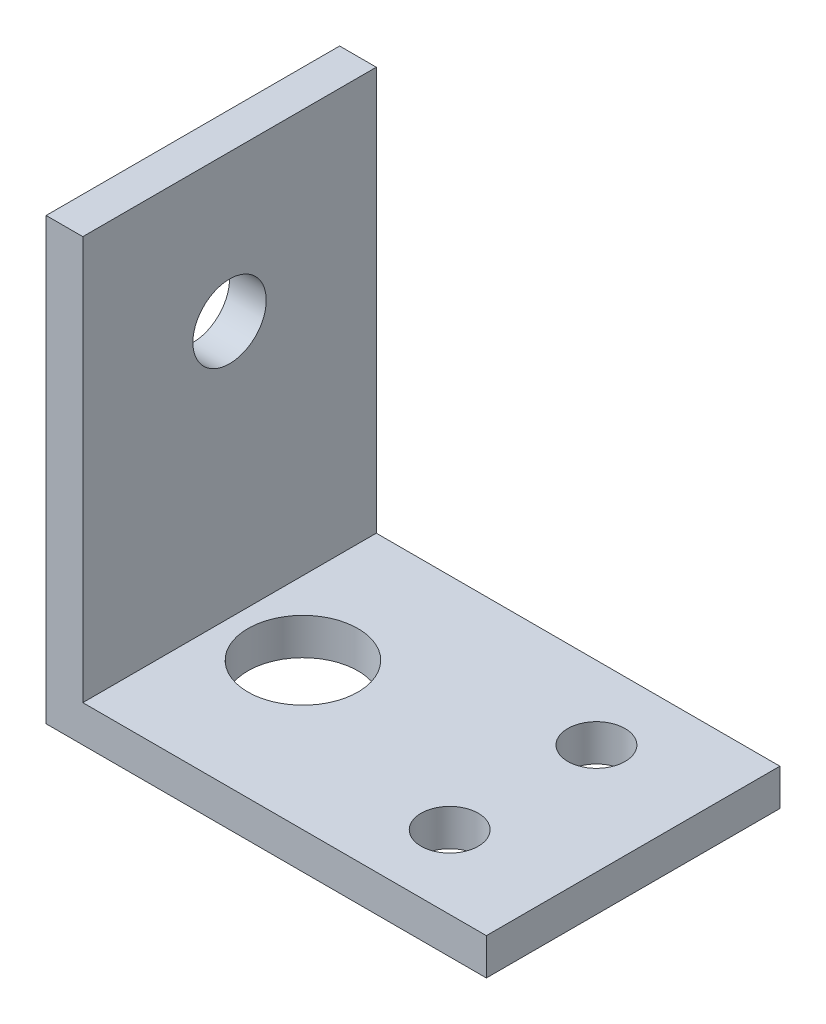
ISO-10303-21;
HEADER;
FILE_DESCRIPTION(('STEP AP214'),'2;1');
FILE_NAME('part.step','',(''),(''),'','','');
FILE_SCHEMA(('AUTOMOTIVE_DESIGN { 1 0 10303 214 1 1 1 1 }'));
ENDSEC;
DATA;
#1=APPLICATION_CONTEXT('core data for automotive mechanical design processes');
#2=APPLICATION_PROTOCOL_DEFINITION('international standard','automotive_design',2000,#1);
#3=PRODUCT_CONTEXT('',#1,'mechanical');
#4=PRODUCT('Part','Part','',(#3));
#5=PRODUCT_RELATED_PRODUCT_CATEGORY('part','',(#4));
#6=PRODUCT_DEFINITION_FORMATION('','',#4);
#7=PRODUCT_DEFINITION_CONTEXT('part definition',#1,'design');
#8=PRODUCT_DEFINITION('design','',#6,#7);
#9=PRODUCT_DEFINITION_SHAPE('','',#8);
#10=(LENGTH_UNIT() NAMED_UNIT(*) SI_UNIT(.MILLI.,.METRE.));
#11=(NAMED_UNIT(*) PLANE_ANGLE_UNIT() SI_UNIT($,.RADIAN.));
#12=(NAMED_UNIT(*) SI_UNIT($,.STERADIAN.) SOLID_ANGLE_UNIT());
#13=UNCERTAINTY_MEASURE_WITH_UNIT(LENGTH_MEASURE(1.E-05),#10,'distance_accuracy_value','');
#14=(GEOMETRIC_REPRESENTATION_CONTEXT(3) GLOBAL_UNCERTAINTY_ASSIGNED_CONTEXT((#13)) GLOBAL_UNIT_ASSIGNED_CONTEXT((#10,
#11,#12)) REPRESENTATION_CONTEXT('',''));
#15=CARTESIAN_POINT('',(0.,0.,0.));
#16=DIRECTION('',(0.,0.,1.));
#17=DIRECTION('',(1.,0.,0.));
#18=AXIS2_PLACEMENT_3D('',#15,#16,#17);
#19=CARTESIAN_POINT('',(3.175,0.,25.4));
#20=DIRECTION('',(-1.,0.,0.));
#21=DIRECTION('',(0.,0.,1.));
#22=AXIS2_PLACEMENT_3D('',#19,#20,#21);
#23=PLANE('',#22);
#24=CARTESIAN_POINT('',(3.175,25.4,12.7));
#25=DIRECTION('',(-1.,0.,0.));
#26=DIRECTION('',(0.,0.,1.));
#27=AXIS2_PLACEMENT_3D('',#24,#25,#26);
#28=CIRCLE('',#27,3.175);
#29=CARTESIAN_POINT('',(3.175,25.4,15.875));
#30=VERTEX_POINT('',#29);
#31=EDGE_CURVE('E146',#30,#30,#28,.T.);
#32=ORIENTED_EDGE('',*,*,#31,.T.);
#33=EDGE_LOOP('',(#32));
#34=FACE_BOUND('',#33,.T.);
#35=DIRECTION('',(0.,1.,0.));
#36=VECTOR('',#35,1.);
#37=CARTESIAN_POINT('',(3.175,0.,0.));
#38=LINE('',#37,#36);
#39=CARTESIAN_POINT('',(3.175,3.175,0.));
#40=VERTEX_POINT('',#39);
#41=CARTESIAN_POINT('',(3.175,38.1,0.));
#42=VERTEX_POINT('',#41);
#43=EDGE_CURVE('E116',#40,#42,#38,.T.);
#44=ORIENTED_EDGE('',*,*,#43,.T.);
#45=DIRECTION('',(0.,0.,-1.));
#46=VECTOR('',#45,1.);
#47=CARTESIAN_POINT('',(3.175,38.1,25.4));
#48=LINE('',#47,#46);
#49=CARTESIAN_POINT('',(3.175,38.1,25.4));
#50=VERTEX_POINT('',#49);
#51=EDGE_CURVE('E11',#50,#42,#48,.T.);
#52=ORIENTED_EDGE('',*,*,#51,.F.);
#53=DIRECTION('',(0.,1.,0.));
#54=VECTOR('',#53,1.);
#55=CARTESIAN_POINT('',(3.175,0.,25.4));
#56=LINE('',#55,#54);
#57=CARTESIAN_POINT('',(3.175,3.175,25.4));
#58=VERTEX_POINT('',#57);
#59=EDGE_CURVE('E81',#58,#50,#56,.T.);
#60=ORIENTED_EDGE('',*,*,#59,.F.);
#61=DIRECTION('',(0.,0.,-1.));
#62=VECTOR('',#61,1.);
#63=CARTESIAN_POINT('',(3.175,3.175,25.4));
#64=LINE('',#63,#62);
#65=EDGE_CURVE('E112',#58,#40,#64,.T.);
#66=ORIENTED_EDGE('',*,*,#65,.T.);
#67=EDGE_LOOP('',(#44,#52,#60,#66));
#68=FACE_BOUND('',#67,.T.);
#69=ADVANCED_FACE('F33',(#34,#68),#23,.F.);
#70=CARTESIAN_POINT('',(0.,38.1,25.4));
#71=DIRECTION('',(0.,1.,0.));
#72=DIRECTION('',(0.,0.,1.));
#73=AXIS2_PLACEMENT_3D('',#70,#71,#72);
#74=PLANE('',#73);
#75=DIRECTION('',(1.,0.,0.));
#76=VECTOR('',#75,1.);
#77=CARTESIAN_POINT('',(0.,38.1,0.));
#78=LINE('',#77,#76);
#79=CARTESIAN_POINT('',(0.,38.1,0.));
#80=VERTEX_POINT('',#79);
#81=EDGE_CURVE('E119',#80,#42,#78,.T.);
#82=ORIENTED_EDGE('',*,*,#81,.F.);
#83=DIRECTION('',(0.,0.,-1.));
#84=VECTOR('',#83,1.);
#85=CARTESIAN_POINT('',(0.,38.1,25.4));
#86=LINE('',#85,#84);
#87=CARTESIAN_POINT('',(0.,38.1,25.4));
#88=VERTEX_POINT('',#87);
#89=EDGE_CURVE('E42',#88,#80,#86,.T.);
#90=ORIENTED_EDGE('',*,*,#89,.F.);
#91=DIRECTION('',(1.,0.,0.));
#92=VECTOR('',#91,1.);
#93=CARTESIAN_POINT('',(0.,38.1,25.4));
#94=LINE('',#93,#92);
#95=EDGE_CURVE('E156',#88,#50,#94,.T.);
#96=ORIENTED_EDGE('',*,*,#95,.T.);
#97=ORIENTED_EDGE('',*,*,#51,.T.);
#98=EDGE_LOOP('',(#82,#90,#96,#97));
#99=FACE_BOUND('',#98,.T.);
#100=ADVANCED_FACE('F178',(#99),#74,.T.);
#101=CARTESIAN_POINT('',(0.,0.,25.4));
#102=DIRECTION('',(-1.,0.,0.));
#103=DIRECTION('',(0.,0.,1.));
#104=AXIS2_PLACEMENT_3D('',#101,#102,#103);
#105=PLANE('',#104);
#106=CARTESIAN_POINT('',(0.,25.4,12.7));
#107=DIRECTION('',(-1.,0.,0.));
#108=DIRECTION('',(0.,0.,1.));
#109=AXIS2_PLACEMENT_3D('',#106,#107,#108);
#110=CIRCLE('',#109,3.175);
#111=CARTESIAN_POINT('',(0.,25.4,15.875));
#112=VERTEX_POINT('',#111);
#113=EDGE_CURVE('E187',#112,#112,#110,.T.);
#114=ORIENTED_EDGE('',*,*,#113,.F.);
#115=EDGE_LOOP('',(#114));
#116=FACE_BOUND('',#115,.T.);
#117=DIRECTION('',(0.,1.,0.));
#118=VECTOR('',#117,1.);
#119=CARTESIAN_POINT('',(0.,0.,0.));
#120=LINE('',#119,#118);
#121=CARTESIAN_POINT('',(0.,0.,0.));
#122=VERTEX_POINT('',#121);
#123=EDGE_CURVE('E123',#122,#80,#120,.T.);
#124=ORIENTED_EDGE('',*,*,#123,.F.);
#125=DIRECTION('',(0.,0.,-1.));
#126=VECTOR('',#125,1.);
#127=CARTESIAN_POINT('',(0.,0.,25.4));
#128=LINE('',#127,#126);
#129=CARTESIAN_POINT('',(0.,0.,25.4));
#130=VERTEX_POINT('',#129);
#131=EDGE_CURVE('E102',#130,#122,#128,.T.);
#132=ORIENTED_EDGE('',*,*,#131,.F.);
#133=DIRECTION('',(0.,1.,0.));
#134=VECTOR('',#133,1.);
#135=CARTESIAN_POINT('',(0.,0.,25.4));
#136=LINE('',#135,#134);
#137=EDGE_CURVE('E108',#130,#88,#136,.T.);
#138=ORIENTED_EDGE('',*,*,#137,.T.);
#139=ORIENTED_EDGE('',*,*,#89,.T.);
#140=EDGE_LOOP('',(#124,#132,#138,#139));
#141=FACE_BOUND('',#140,.T.);
#142=ADVANCED_FACE('F160',(#116,#141),#105,.T.);
#143=CARTESIAN_POINT('',(0.,0.,25.4));
#144=DIRECTION('',(0.,-1.,0.));
#145=DIRECTION('',(0.,0.,-1.));
#146=AXIS2_PLACEMENT_3D('',#143,#144,#145);
#147=PLANE('',#146);
#148=CARTESIAN_POINT('',(28.575,0.,6.34999999999999));
#149=DIRECTION('',(0.,-1.,0.));
#150=DIRECTION('',(0.,0.,-1.));
#151=AXIS2_PLACEMENT_3D('',#148,#149,#150);
#152=CIRCLE('',#151,2.4765);
#153=CARTESIAN_POINT('',(28.575,0.,3.87349999999999));
#154=VERTEX_POINT('',#153);
#155=EDGE_CURVE('E135',#154,#154,#152,.T.);
#156=ORIENTED_EDGE('',*,*,#155,.F.);
#157=EDGE_LOOP('',(#156));
#158=FACE_BOUND('',#157,.T.);
#159=CARTESIAN_POINT('',(28.575,0.,19.05));
#160=DIRECTION('',(0.,-1.,0.));
#161=DIRECTION('',(0.,0.,-1.));
#162=AXIS2_PLACEMENT_3D('',#159,#160,#161);
#163=CIRCLE('',#162,2.47650000000001);
#164=CARTESIAN_POINT('',(28.575,0.,16.5735));
#165=VERTEX_POINT('',#164);
#166=EDGE_CURVE('E141',#165,#165,#163,.T.);
#167=ORIENTED_EDGE('',*,*,#166,.F.);
#168=EDGE_LOOP('',(#167));
#169=FACE_BOUND('',#168,.T.);
#170=CARTESIAN_POINT('',(9.525,0.,12.7));
#171=DIRECTION('',(0.,1.,0.));
#172=DIRECTION('',(0.,0.,1.));
#173=AXIS2_PLACEMENT_3D('',#170,#171,#172);
#174=CIRCLE('',#173,4.7625);
#175=CARTESIAN_POINT('',(9.525,0.,17.4625));
#176=VERTEX_POINT('',#175);
#177=EDGE_CURVE('E120',#176,#176,#174,.T.);
#178=ORIENTED_EDGE('',*,*,#177,.T.);
#179=EDGE_LOOP('',(#178));
#180=FACE_BOUND('',#179,.T.);
#181=DIRECTION('',(-1.,0.,0.));
#182=VECTOR('',#181,1.);
#183=CARTESIAN_POINT('',(0.,0.,0.));
#184=LINE('',#183,#182);
#185=CARTESIAN_POINT('',(38.1,0.,0.));
#186=VERTEX_POINT('',#185);
#187=EDGE_CURVE('E97',#186,#122,#184,.T.);
#188=ORIENTED_EDGE('',*,*,#187,.F.);
#189=DIRECTION('',(0.,0.,-1.));
#190=VECTOR('',#189,1.);
#191=CARTESIAN_POINT('',(38.1,0.,25.4));
#192=LINE('',#191,#190);
#193=CARTESIAN_POINT('',(38.1,0.,25.4));
#194=VERTEX_POINT('',#193);
#195=EDGE_CURVE('E92',#194,#186,#192,.T.);
#196=ORIENTED_EDGE('',*,*,#195,.F.);
#197=DIRECTION('',(-1.,0.,0.));
#198=VECTOR('',#197,1.);
#199=CARTESIAN_POINT('',(0.,0.,25.4));
#200=LINE('',#199,#198);
#201=EDGE_CURVE('E95',#194,#130,#200,.T.);
#202=ORIENTED_EDGE('',*,*,#201,.T.);
#203=ORIENTED_EDGE('',*,*,#131,.T.);
#204=EDGE_LOOP('',(#188,#196,#202,#203));
#205=FACE_BOUND('',#204,.T.);
#206=ADVANCED_FACE('F94',(#158,#169,#180,#205),#147,.T.);
#207=CARTESIAN_POINT('',(38.1,3.175,25.4));
#208=DIRECTION('',(1.,0.,0.));
#209=DIRECTION('',(0.,0.,-1.));
#210=AXIS2_PLACEMENT_3D('',#207,#208,#209);
#211=PLANE('',#210);
#212=DIRECTION('',(0.,-1.,0.));
#213=VECTOR('',#212,1.);
#214=CARTESIAN_POINT('',(38.1,3.175,0.));
#215=LINE('',#214,#213);
#216=CARTESIAN_POINT('',(38.1,3.175,0.));
#217=VERTEX_POINT('',#216);
#218=EDGE_CURVE('E127',#217,#186,#215,.T.);
#219=ORIENTED_EDGE('',*,*,#218,.F.);
#220=DIRECTION('',(0.,0.,-1.));
#221=VECTOR('',#220,1.);
#222=CARTESIAN_POINT('',(38.1,3.175,25.4));
#223=LINE('',#222,#221);
#224=CARTESIAN_POINT('',(38.1,3.175,25.4));
#225=VERTEX_POINT('',#224);
#226=EDGE_CURVE('E72',#225,#217,#223,.T.);
#227=ORIENTED_EDGE('',*,*,#226,.F.);
#228=DIRECTION('',(0.,-1.,0.));
#229=VECTOR('',#228,1.);
#230=CARTESIAN_POINT('',(38.1,3.175,25.4));
#231=LINE('',#230,#229);
#232=EDGE_CURVE('E106',#225,#194,#231,.T.);
#233=ORIENTED_EDGE('',*,*,#232,.T.);
#234=ORIENTED_EDGE('',*,*,#195,.T.);
#235=EDGE_LOOP('',(#219,#227,#233,#234));
#236=FACE_BOUND('',#235,.T.);
#237=ADVANCED_FACE('F110',(#236),#211,.T.);
#238=CARTESIAN_POINT('',(0.,3.175,25.4));
#239=DIRECTION('',(0.,-1.,0.));
#240=DIRECTION('',(0.,0.,-1.));
#241=AXIS2_PLACEMENT_3D('',#238,#239,#240);
#242=PLANE('',#241);
#243=CARTESIAN_POINT('',(28.575,3.175,6.34999999999999));
#244=DIRECTION('',(0.,-1.,0.));
#245=DIRECTION('',(0.,0.,-1.));
#246=AXIS2_PLACEMENT_3D('',#243,#244,#245);
#247=CIRCLE('',#246,2.4765);
#248=CARTESIAN_POINT('',(28.575,3.175,3.87349999999999));
#249=VERTEX_POINT('',#248);
#250=EDGE_CURVE('E36',#249,#249,#247,.T.);
#251=ORIENTED_EDGE('',*,*,#250,.T.);
#252=EDGE_LOOP('',(#251));
#253=FACE_BOUND('',#252,.T.);
#254=CARTESIAN_POINT('',(28.575,3.175,19.05));
#255=DIRECTION('',(0.,-1.,0.));
#256=DIRECTION('',(0.,0.,-1.));
#257=AXIS2_PLACEMENT_3D('',#254,#255,#256);
#258=CIRCLE('',#257,2.47650000000001);
#259=CARTESIAN_POINT('',(28.575,3.175,16.5735));
#260=VERTEX_POINT('',#259);
#261=EDGE_CURVE('E133',#260,#260,#258,.T.);
#262=ORIENTED_EDGE('',*,*,#261,.T.);
#263=EDGE_LOOP('',(#262));
#264=FACE_BOUND('',#263,.T.);
#265=CARTESIAN_POINT('',(9.525,3.175,12.7));
#266=DIRECTION('',(0.,1.,0.));
#267=DIRECTION('',(0.,0.,1.));
#268=AXIS2_PLACEMENT_3D('',#265,#266,#267);
#269=CIRCLE('',#268,4.7625);
#270=CARTESIAN_POINT('',(9.525,3.175,17.4625));
#271=VERTEX_POINT('',#270);
#272=EDGE_CURVE('E139',#271,#271,#269,.T.);
#273=ORIENTED_EDGE('',*,*,#272,.F.);
#274=EDGE_LOOP('',(#273));
#275=FACE_BOUND('',#274,.T.);
#276=DIRECTION('',(1.,0.,0.));
#277=VECTOR('',#276,1.);
#278=CARTESIAN_POINT('',(0.,3.175,0.));
#279=LINE('',#278,#277);
#280=EDGE_CURVE('E75',#217,#40,#279,.F.);
#281=ORIENTED_EDGE('',*,*,#280,.T.);
#282=ORIENTED_EDGE('',*,*,#65,.F.);
#283=DIRECTION('',(1.,0.,0.));
#284=VECTOR('',#283,1.);
#285=CARTESIAN_POINT('',(0.,3.175,25.4));
#286=LINE('',#285,#284);
#287=EDGE_CURVE('E51',#225,#58,#286,.F.);
#288=ORIENTED_EDGE('',*,*,#287,.F.);
#289=ORIENTED_EDGE('',*,*,#226,.T.);
#290=EDGE_LOOP('',(#281,#282,#288,#289));
#291=FACE_BOUND('',#290,.T.);
#292=ADVANCED_FACE('F166',(#253,#264,#275,#291),#242,.F.);
#293=CARTESIAN_POINT('',(0.,0.,25.4));
#294=DIRECTION('',(0.,0.,-1.));
#295=DIRECTION('',(-1.,0.,0.));
#296=AXIS2_PLACEMENT_3D('',#293,#294,#295);
#297=PLANE('',#296);
#298=ORIENTED_EDGE('',*,*,#59,.T.);
#299=ORIENTED_EDGE('',*,*,#95,.F.);
#300=ORIENTED_EDGE('',*,*,#137,.F.);
#301=ORIENTED_EDGE('',*,*,#201,.F.);
#302=ORIENTED_EDGE('',*,*,#232,.F.);
#303=ORIENTED_EDGE('',*,*,#287,.T.);
#304=EDGE_LOOP('',(#298,#299,#300,#301,#302,#303));
#305=FACE_BOUND('',#304,.T.);
#306=ADVANCED_FACE('F105',(#305),#297,.F.);
#307=CARTESIAN_POINT('',(0.,0.,0.));
#308=DIRECTION('',(0.,0.,-1.));
#309=DIRECTION('',(-1.,0.,0.));
#310=AXIS2_PLACEMENT_3D('',#307,#308,#309);
#311=PLANE('',#310);
#312=ORIENTED_EDGE('',*,*,#43,.F.);
#313=ORIENTED_EDGE('',*,*,#280,.F.);
#314=ORIENTED_EDGE('',*,*,#218,.T.);
#315=ORIENTED_EDGE('',*,*,#187,.T.);
#316=ORIENTED_EDGE('',*,*,#123,.T.);
#317=ORIENTED_EDGE('',*,*,#81,.T.);
#318=EDGE_LOOP('',(#312,#313,#314,#315,#316,#317));
#319=FACE_BOUND('',#318,.T.);
#320=ADVANCED_FACE('F164',(#319),#311,.T.);
#321=CARTESIAN_POINT('',(9.525,0.,12.7));
#322=DIRECTION('',(0.,1.,0.));
#323=DIRECTION('',(0.,0.,1.));
#324=AXIS2_PLACEMENT_3D('',#321,#322,#323);
#325=CYLINDRICAL_SURFACE('',#324,4.7625);
#326=ORIENTED_EDGE('',*,*,#177,.F.);
#327=EDGE_LOOP('',(#326));
#328=FACE_BOUND('',#327,.T.);
#329=ORIENTED_EDGE('',*,*,#272,.T.);
#330=EDGE_LOOP('',(#329));
#331=FACE_BOUND('',#330,.T.);
#332=ADVANCED_FACE('F207',(#328,#331),#325,.F.);
#333=CARTESIAN_POINT('',(28.575,38.1,19.05));
#334=DIRECTION('',(0.,-1.,0.));
#335=DIRECTION('',(0.,0.,-1.));
#336=AXIS2_PLACEMENT_3D('',#333,#334,#335);
#337=CYLINDRICAL_SURFACE('',#336,2.47650000000001);
#338=ORIENTED_EDGE('',*,*,#166,.T.);
#339=EDGE_LOOP('',(#338));
#340=FACE_BOUND('',#339,.T.);
#341=ORIENTED_EDGE('',*,*,#261,.F.);
#342=EDGE_LOOP('',(#341));
#343=FACE_BOUND('',#342,.T.);
#344=ADVANCED_FACE('F210',(#340,#343),#337,.F.);
#345=CARTESIAN_POINT('',(28.575,38.1,6.34999999999999));
#346=DIRECTION('',(0.,-1.,0.));
#347=DIRECTION('',(0.,0.,-1.));
#348=AXIS2_PLACEMENT_3D('',#345,#346,#347);
#349=CYLINDRICAL_SURFACE('',#348,2.4765);
#350=ORIENTED_EDGE('',*,*,#155,.T.);
#351=EDGE_LOOP('',(#350));
#352=FACE_BOUND('',#351,.T.);
#353=ORIENTED_EDGE('',*,*,#250,.F.);
#354=EDGE_LOOP('',(#353));
#355=FACE_BOUND('',#354,.T.);
#356=ADVANCED_FACE('F218',(#352,#355),#349,.F.);
#357=CARTESIAN_POINT('',(38.1,25.4,12.7));
#358=DIRECTION('',(-1.,0.,0.));
#359=DIRECTION('',(0.,0.,1.));
#360=AXIS2_PLACEMENT_3D('',#357,#358,#359);
#361=CYLINDRICAL_SURFACE('',#360,3.175);
#362=ORIENTED_EDGE('',*,*,#113,.T.);
#363=EDGE_LOOP('',(#362));
#364=FACE_BOUND('',#363,.T.);
#365=ORIENTED_EDGE('',*,*,#31,.F.);
#366=EDGE_LOOP('',(#365));
#367=FACE_BOUND('',#366,.T.);
#368=ADVANCED_FACE('F191',(#364,#367),#361,.F.);
#369=CLOSED_SHELL('',(#69,#100,#142,#206,#237,#292,#306,#320,#332,#344,#356,#368));
#370=MANIFOLD_SOLID_BREP('B2',#369);
#371=ADVANCED_BREP_SHAPE_REPRESENTATION('',(#18,#370),#14);
#372=SHAPE_DEFINITION_REPRESENTATION(#9,#371);
ENDSEC;
END-ISO-10303-21;
